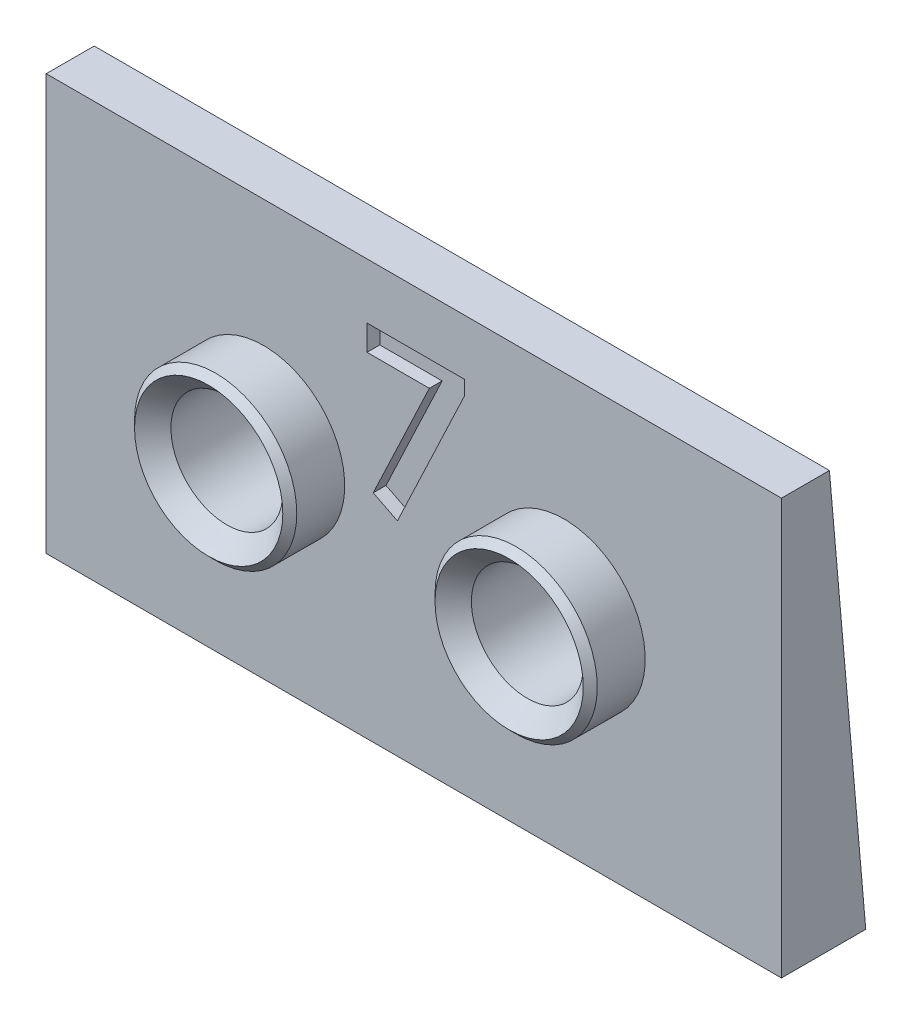
ISO-10303-21;
HEADER;
FILE_DESCRIPTION(('STEP AP214'),'2;1');
FILE_NAME('part.step','',(''),(''),'','','');
FILE_SCHEMA(('AUTOMOTIVE_DESIGN { 1 0 10303 214 1 1 1 1 }'));
ENDSEC;
DATA;
#1=APPLICATION_CONTEXT('core data for automotive mechanical design processes');
#2=APPLICATION_PROTOCOL_DEFINITION('international standard','automotive_design',2000,#1);
#3=PRODUCT_CONTEXT('',#1,'mechanical');
#4=PRODUCT('Part','Part','',(#3));
#5=PRODUCT_RELATED_PRODUCT_CATEGORY('part','',(#4));
#6=PRODUCT_DEFINITION_FORMATION('','',#4);
#7=PRODUCT_DEFINITION_CONTEXT('part definition',#1,'design');
#8=PRODUCT_DEFINITION('design','',#6,#7);
#9=PRODUCT_DEFINITION_SHAPE('','',#8);
#10=(LENGTH_UNIT() NAMED_UNIT(*) SI_UNIT(.MILLI.,.METRE.));
#11=(NAMED_UNIT(*) PLANE_ANGLE_UNIT() SI_UNIT($,.RADIAN.));
#12=(NAMED_UNIT(*) SI_UNIT($,.STERADIAN.) SOLID_ANGLE_UNIT());
#13=UNCERTAINTY_MEASURE_WITH_UNIT(LENGTH_MEASURE(1.E-05),#10,'distance_accuracy_value','');
#14=(GEOMETRIC_REPRESENTATION_CONTEXT(3) GLOBAL_UNCERTAINTY_ASSIGNED_CONTEXT((#13)) GLOBAL_UNIT_ASSIGNED_CONTEXT((#10,
#11,#12)) REPRESENTATION_CONTEXT('',''));
#15=CARTESIAN_POINT('',(0.,0.,0.));
#16=DIRECTION('',(0.,0.,1.));
#17=DIRECTION('',(1.,0.,0.));
#18=AXIS2_PLACEMENT_3D('',#15,#16,#17);
#19=CARTESIAN_POINT('',(0.,0.,3.));
#20=DIRECTION('',(0.,0.,-1.));
#21=DIRECTION('',(-1.,0.,0.));
#22=AXIS2_PLACEMENT_3D('',#19,#20,#21);
#23=PLANE('',#22);
#24=DIRECTION('',(0.,-1.,0.));
#25=VECTOR('',#24,1.);
#26=CARTESIAN_POINT('',(0.,0.,3.));
#27=LINE('',#26,#25);
#28=CARTESIAN_POINT('',(0.,26.,3.));
#29=VERTEX_POINT('',#28);
#30=CARTESIAN_POINT('',(0.,0.,3.));
#31=VERTEX_POINT('',#30);
#32=EDGE_CURVE('E167',#29,#31,#27,.T.);
#33=ORIENTED_EDGE('',*,*,#32,.T.);
#34=DIRECTION('',(1.,0.,0.));
#35=VECTOR('',#34,1.);
#36=CARTESIAN_POINT('',(0.,0.,3.));
#37=LINE('',#36,#35);
#38=CARTESIAN_POINT('',(46.,0.,3.));
#39=VERTEX_POINT('',#38);
#40=EDGE_CURVE('E169',#31,#39,#37,.T.);
#41=ORIENTED_EDGE('',*,*,#40,.T.);
#42=DIRECTION('',(0.,1.,0.));
#43=VECTOR('',#42,1.);
#44=CARTESIAN_POINT('',(46.,0.,3.));
#45=LINE('',#44,#43);
#46=CARTESIAN_POINT('',(46.,26.,3.));
#47=VERTEX_POINT('',#46);
#48=EDGE_CURVE('E171',#39,#47,#45,.T.);
#49=ORIENTED_EDGE('',*,*,#48,.T.);
#50=DIRECTION('',(-1.,0.,0.));
#51=VECTOR('',#50,1.);
#52=CARTESIAN_POINT('',(0.,26.,3.));
#53=LINE('',#52,#51);
#54=EDGE_CURVE('E56',#47,#29,#53,.T.);
#55=ORIENTED_EDGE('',*,*,#54,.T.);
#56=EDGE_LOOP('',(#33,#41,#49,#55));
#57=FACE_BOUND('',#56,.T.);
#58=CARTESIAN_POINT('',(13.6,13.,3.));
#59=DIRECTION('',(0.,0.,-1.));
#60=DIRECTION('',(-1.,0.,0.));
#61=AXIS2_PLACEMENT_3D('',#58,#59,#60);
#62=CIRCLE('',#61,5.075);
#63=CARTESIAN_POINT('',(8.525,13.,3.));
#64=VERTEX_POINT('',#63);
#65=EDGE_CURVE('E186',#64,#64,#62,.F.);
#66=ORIENTED_EDGE('',*,*,#65,.F.);
#67=EDGE_LOOP('',(#66));
#68=FACE_BOUND('',#67,.T.);
#69=CARTESIAN_POINT('',(32.4,13.,3.));
#70=DIRECTION('',(0.,0.,-1.));
#71=DIRECTION('',(-1.,0.,0.));
#72=AXIS2_PLACEMENT_3D('',#69,#70,#71);
#73=CIRCLE('',#72,5.075);
#74=CARTESIAN_POINT('',(27.325,13.,3.));
#75=VERTEX_POINT('',#74);
#76=EDGE_CURVE('E189',#75,#75,#73,.F.);
#77=ORIENTED_EDGE('',*,*,#76,.F.);
#78=EDGE_LOOP('',(#77));
#79=FACE_BOUND('',#78,.T.);
#80=DIRECTION('',(0.,1.,0.));
#81=VECTOR('',#80,1.);
#82=CARTESIAN_POINT('',(20.0692307692308,20.9375,3.));
#83=LINE('',#82,#81);
#84=CARTESIAN_POINT('',(20.0692307692308,20.9375,3.));
#85=VERTEX_POINT('',#84);
#86=CARTESIAN_POINT('',(20.0692307692308,22.525,3.));
#87=VERTEX_POINT('',#86);
#88=EDGE_CURVE('E48',#85,#87,#83,.T.);
#89=ORIENTED_EDGE('',*,*,#88,.T.);
#90=DIRECTION('',(1.,0.,0.));
#91=VECTOR('',#90,1.);
#92=CARTESIAN_POINT('',(20.0692307692308,22.525,3.));
#93=LINE('',#92,#91);
#94=CARTESIAN_POINT('',(26.175,22.525,3.));
#95=VERTEX_POINT('',#94);
#96=EDGE_CURVE('E137',#87,#95,#93,.T.);
#97=ORIENTED_EDGE('',*,*,#96,.T.);
#98=DIRECTION('',(0.,-1.,0.));
#99=VECTOR('',#98,1.);
#100=CARTESIAN_POINT('',(26.175,22.525,3.));
#101=LINE('',#100,#99);
#102=CARTESIAN_POINT('',(26.175,21.6377554086538,3.));
#103=VERTEX_POINT('',#102);
#104=EDGE_CURVE('E405',#95,#103,#101,.T.);
#105=ORIENTED_EDGE('',*,*,#104,.T.);
#106=DIRECTION('',(-0.42761047141976,-0.903963099209348,0.));
#107=VECTOR('',#106,1.);
#108=CARTESIAN_POINT('',(26.175,21.6377554086538,3.));
#109=LINE('',#108,#107);
#110=CARTESIAN_POINT('',(21.9734675480769,12.7557692307692,3.));
#111=VERTEX_POINT('',#110);
#112=EDGE_CURVE('E412',#103,#111,#109,.T.);
#113=ORIENTED_EDGE('',*,*,#112,.T.);
#114=DIRECTION('',(-0.893073384293623,0.44991102483306,0.));
#115=VECTOR('',#114,1.);
#116=CARTESIAN_POINT('',(21.9734675480769,12.7557692307692,3.));
#117=LINE('',#116,#115);
#118=CARTESIAN_POINT('',(20.4584735576923,13.5189903846154,3.));
#119=VERTEX_POINT('',#118);
#120=EDGE_CURVE('E415',#111,#119,#117,.T.);
#121=ORIENTED_EDGE('',*,*,#120,.T.);
#122=DIRECTION('',(0.427766523959501,0.903889263670946,0.));
#123=VECTOR('',#122,1.);
#124=CARTESIAN_POINT('',(20.4584735576923,13.5189903846154,3.));
#125=LINE('',#124,#123);
#126=CARTESIAN_POINT('',(23.9692908653846,20.9375,3.));
#127=VERTEX_POINT('',#126);
#128=EDGE_CURVE('E418',#119,#127,#125,.T.);
#129=ORIENTED_EDGE('',*,*,#128,.T.);
#130=DIRECTION('',(-1.,0.,0.));
#131=VECTOR('',#130,1.);
#132=CARTESIAN_POINT('',(23.9692908653846,20.9375,3.));
#133=LINE('',#132,#131);
#134=EDGE_CURVE('E133',#127,#85,#133,.T.);
#135=ORIENTED_EDGE('',*,*,#134,.T.);
#136=EDGE_LOOP('',(#89,#97,#105,#113,#121,#129,#135));
#137=FACE_BOUND('',#136,.T.);
#138=ADVANCED_FACE('F33',(#57,#68,#79,#137),#23,.F.);
#139=CARTESIAN_POINT('',(0.,0.,3.));
#140=DIRECTION('',(1.,0.,0.));
#141=DIRECTION('',(0.,0.,-1.));
#142=AXIS2_PLACEMENT_3D('',#139,#140,#141);
#143=PLANE('',#142);
#144=DIRECTION('',(0.,0.,-1.));
#145=VECTOR('',#144,1.);
#146=CARTESIAN_POINT('',(0.,26.,3.));
#147=LINE('',#146,#145);
#148=CARTESIAN_POINT('',(0.,26.,0.));
#149=VERTEX_POINT('',#148);
#150=EDGE_CURVE('E174',#29,#149,#147,.T.);
#151=ORIENTED_EDGE('',*,*,#150,.T.);
#152=DIRECTION('',(0.,-0.996194698091746,-0.0871557427476514));
#153=VECTOR('',#152,1.);
#154=CARTESIAN_POINT('',(0.,26.,0.));
#155=LINE('',#154,#153);
#156=CARTESIAN_POINT('',(0.,0.,-2.27470525167385));
#157=VERTEX_POINT('',#156);
#158=EDGE_CURVE('E161',#149,#157,#155,.T.);
#159=ORIENTED_EDGE('',*,*,#158,.T.);
#160=DIRECTION('',(0.,0.,-1.));
#161=VECTOR('',#160,1.);
#162=CARTESIAN_POINT('',(0.,0.,3.));
#163=LINE('',#162,#161);
#164=EDGE_CURVE('E184',#31,#157,#163,.T.);
#165=ORIENTED_EDGE('',*,*,#164,.F.);
#166=ORIENTED_EDGE('',*,*,#32,.F.);
#167=EDGE_LOOP('',(#151,#159,#165,#166));
#168=FACE_BOUND('',#167,.T.);
#169=ADVANCED_FACE('F224',(#168),#143,.F.);
#170=CARTESIAN_POINT('',(0.,0.,3.));
#171=DIRECTION('',(0.,1.,0.));
#172=DIRECTION('',(0.,0.,1.));
#173=AXIS2_PLACEMENT_3D('',#170,#171,#172);
#174=PLANE('',#173);
#175=ORIENTED_EDGE('',*,*,#164,.T.);
#176=DIRECTION('',(-1.,0.,0.));
#177=VECTOR('',#176,1.);
#178=CARTESIAN_POINT('',(72.099315776127,0.,-2.27470525167385));
#179=LINE('',#178,#177);
#180=CARTESIAN_POINT('',(46.,0.,-2.27470525167385));
#181=VERTEX_POINT('',#180);
#182=EDGE_CURVE('E160',#181,#157,#179,.T.);
#183=ORIENTED_EDGE('',*,*,#182,.F.);
#184=DIRECTION('',(0.,0.,-1.));
#185=VECTOR('',#184,1.);
#186=CARTESIAN_POINT('',(46.,0.,3.));
#187=LINE('',#186,#185);
#188=EDGE_CURVE('E182',#39,#181,#187,.T.);
#189=ORIENTED_EDGE('',*,*,#188,.F.);
#190=ORIENTED_EDGE('',*,*,#40,.F.);
#191=EDGE_LOOP('',(#175,#183,#189,#190));
#192=FACE_BOUND('',#191,.T.);
#193=ADVANCED_FACE('F229',(#192),#174,.F.);
#194=CARTESIAN_POINT('',(46.,0.,3.));
#195=DIRECTION('',(-1.,0.,0.));
#196=DIRECTION('',(0.,0.,1.));
#197=AXIS2_PLACEMENT_3D('',#194,#195,#196);
#198=PLANE('',#197);
#199=ORIENTED_EDGE('',*,*,#188,.T.);
#200=DIRECTION('',(0.,0.996194698091746,0.0871557427476514));
#201=VECTOR('',#200,1.);
#202=CARTESIAN_POINT('',(46.,26.,0.));
#203=LINE('',#202,#201);
#204=CARTESIAN_POINT('',(46.,26.,0.));
#205=VERTEX_POINT('',#204);
#206=EDGE_CURVE('E157',#181,#205,#203,.T.);
#207=ORIENTED_EDGE('',*,*,#206,.T.);
#208=DIRECTION('',(0.,0.,-1.));
#209=VECTOR('',#208,1.);
#210=CARTESIAN_POINT('',(46.,26.,3.));
#211=LINE('',#210,#209);
#212=EDGE_CURVE('E179',#47,#205,#211,.T.);
#213=ORIENTED_EDGE('',*,*,#212,.F.);
#214=ORIENTED_EDGE('',*,*,#48,.F.);
#215=EDGE_LOOP('',(#199,#207,#213,#214));
#216=FACE_BOUND('',#215,.T.);
#217=ADVANCED_FACE('F240',(#216),#198,.F.);
#218=CARTESIAN_POINT('',(0.,26.,3.));
#219=DIRECTION('',(0.,-1.,0.));
#220=DIRECTION('',(0.,0.,-1.));
#221=AXIS2_PLACEMENT_3D('',#218,#219,#220);
#222=PLANE('',#221);
#223=DIRECTION('',(-1.,0.,0.));
#224=VECTOR('',#223,1.);
#225=CARTESIAN_POINT('',(0.,26.,0.));
#226=LINE('',#225,#224);
#227=EDGE_CURVE('E159',#205,#149,#226,.T.);
#228=ORIENTED_EDGE('',*,*,#227,.T.);
#229=ORIENTED_EDGE('',*,*,#150,.F.);
#230=ORIENTED_EDGE('',*,*,#54,.F.);
#231=ORIENTED_EDGE('',*,*,#212,.T.);
#232=EDGE_LOOP('',(#228,#229,#230,#231));
#233=FACE_BOUND('',#232,.T.);
#234=ADVANCED_FACE('F237',(#233),#222,.F.);
#235=CARTESIAN_POINT('',(13.6,13.,6.5));
#236=DIRECTION('',(0.,0.,-1.));
#237=DIRECTION('',(-1.,0.,0.));
#238=AXIS2_PLACEMENT_3D('',#235,#236,#237);
#239=CYLINDRICAL_SURFACE('',#238,5.075);
#240=CARTESIAN_POINT('',(13.6,13.,6.));
#241=DIRECTION('',(0.,0.,1.));
#242=DIRECTION('',(1.,0.,0.));
#243=AXIS2_PLACEMENT_3D('',#240,#241,#242);
#244=CIRCLE('',#243,5.075);
#245=CARTESIAN_POINT('',(18.675,13.,6.));
#246=VERTEX_POINT('',#245);
#247=EDGE_CURVE('E11',#246,#246,#244,.F.);
#248=ORIENTED_EDGE('',*,*,#247,.T.);
#249=EDGE_LOOP('',(#248));
#250=FACE_BOUND('',#249,.T.);
#251=ORIENTED_EDGE('',*,*,#65,.T.);
#252=EDGE_LOOP('',(#251));
#253=FACE_BOUND('',#252,.T.);
#254=ADVANCED_FACE('F235',(#250,#253),#239,.T.);
#255=CARTESIAN_POINT('',(13.6,13.,6.5));
#256=DIRECTION('',(0.,0.,-1.));
#257=DIRECTION('',(-1.,0.,0.));
#258=AXIS2_PLACEMENT_3D('',#255,#256,#257);
#259=CYLINDRICAL_SURFACE('',#258,3.5);
#260=CARTESIAN_POINT('',(13.6,13.,5.30000000000001));
#261=DIRECTION('',(0.,0.,1.));
#262=DIRECTION('',(1.,0.,0.));
#263=AXIS2_PLACEMENT_3D('',#260,#261,#262);
#264=CIRCLE('',#263,3.5);
#265=CARTESIAN_POINT('',(17.1,13.,5.30000000000001));
#266=VERTEX_POINT('',#265);
#267=EDGE_CURVE('E199',#266,#266,#264,.T.);
#268=ORIENTED_EDGE('',*,*,#267,.T.);
#269=EDGE_LOOP('',(#268));
#270=FACE_BOUND('',#269,.T.);
#271=CARTESIAN_POINT('',(13.6,13.,-1.13735262583692));
#272=DIRECTION('',(0.,0.0871557427476514,-0.996194698091746));
#273=DIRECTION('',(0.,0.996194698091746,0.0871557427476514));
#274=AXIS2_PLACEMENT_3D('',#271,#272,#273);
#275=ELLIPSE('',#274,3.51336943140171,3.5);
#276=CARTESIAN_POINT('',(13.6,16.5,-0.831142303496212));
#277=VERTEX_POINT('',#276);
#278=EDGE_CURVE('E164',#277,#277,#275,.T.);
#279=ORIENTED_EDGE('',*,*,#278,.T.);
#280=EDGE_LOOP('',(#279));
#281=FACE_BOUND('',#280,.T.);
#282=ADVANCED_FACE('F372',(#270,#281),#259,.F.);
#283=CARTESIAN_POINT('',(32.4,13.,6.5));
#284=DIRECTION('',(0.,0.,-1.));
#285=DIRECTION('',(-1.,0.,0.));
#286=AXIS2_PLACEMENT_3D('',#283,#284,#285);
#287=CYLINDRICAL_SURFACE('',#286,5.075);
#288=CARTESIAN_POINT('',(32.4,13.,6.));
#289=DIRECTION('',(0.,0.,1.));
#290=DIRECTION('',(1.,0.,0.));
#291=AXIS2_PLACEMENT_3D('',#288,#289,#290);
#292=CIRCLE('',#291,5.075);
#293=CARTESIAN_POINT('',(37.475,13.,6.));
#294=VERTEX_POINT('',#293);
#295=EDGE_CURVE('E205',#294,#294,#292,.F.);
#296=ORIENTED_EDGE('',*,*,#295,.T.);
#297=EDGE_LOOP('',(#296));
#298=FACE_BOUND('',#297,.T.);
#299=ORIENTED_EDGE('',*,*,#76,.T.);
#300=EDGE_LOOP('',(#299));
#301=FACE_BOUND('',#300,.T.);
#302=ADVANCED_FACE('F369',(#298,#301),#287,.T.);
#303=CARTESIAN_POINT('',(32.4,13.,6.5));
#304=DIRECTION('',(0.,0.,-1.));
#305=DIRECTION('',(-1.,0.,0.));
#306=AXIS2_PLACEMENT_3D('',#303,#304,#305);
#307=CYLINDRICAL_SURFACE('',#306,3.5);
#308=CARTESIAN_POINT('',(32.4,13.,5.30000000000001));
#309=DIRECTION('',(0.,0.,1.));
#310=DIRECTION('',(1.,0.,0.));
#311=AXIS2_PLACEMENT_3D('',#308,#309,#310);
#312=CIRCLE('',#311,3.5);
#313=CARTESIAN_POINT('',(35.9,13.,5.30000000000001));
#314=VERTEX_POINT('',#313);
#315=EDGE_CURVE('E192',#314,#314,#312,.T.);
#316=ORIENTED_EDGE('',*,*,#315,.T.);
#317=EDGE_LOOP('',(#316));
#318=FACE_BOUND('',#317,.T.);
#319=CARTESIAN_POINT('',(32.4,13.,-1.13735262583692));
#320=DIRECTION('',(0.,0.0871557427476514,-0.996194698091746));
#321=DIRECTION('',(0.,0.996194698091746,0.0871557427476514));
#322=AXIS2_PLACEMENT_3D('',#319,#320,#321);
#323=ELLIPSE('',#322,3.51336943140172,3.50000000000001);
#324=CARTESIAN_POINT('',(32.4,16.5,-0.831142303496212));
#325=VERTEX_POINT('',#324);
#326=EDGE_CURVE('E154',#325,#325,#323,.T.);
#327=ORIENTED_EDGE('',*,*,#326,.T.);
#328=EDGE_LOOP('',(#327));
#329=FACE_BOUND('',#328,.T.);
#330=ADVANCED_FACE('F365',(#318,#329),#307,.F.);
#331=CARTESIAN_POINT('',(72.099315776127,26.,0.));
#332=DIRECTION('',(0.,0.0871557427476514,-0.996194698091746));
#333=DIRECTION('',(0.,0.996194698091746,0.0871557427476514));
#334=AXIS2_PLACEMENT_3D('',#331,#332,#333);
#335=PLANE('',#334);
#336=CARTESIAN_POINT('',(23.,6.67416366711741,-1.69079159228451));
#337=DIRECTION('',(0.,0.0871557427476514,-0.996194698091746));
#338=DIRECTION('',(0.,0.996194698091746,0.0871557427476514));
#339=AXIS2_PLACEMENT_3D('',#336,#337,#338);
#340=CIRCLE('',#339,2.55);
#341=CARTESIAN_POINT('',(23.,9.21446014725137,-1.468544448278));
#342=VERTEX_POINT('',#341);
#343=EDGE_CURVE('E138',#342,#342,#340,.T.);
#344=ORIENTED_EDGE('',*,*,#343,.F.);
#345=EDGE_LOOP('',(#344));
#346=FACE_BOUND('',#345,.T.);
#347=CARTESIAN_POINT('',(23.,19.3258363328826,-0.583913659389336));
#348=DIRECTION('',(0.,0.0871557427476514,-0.996194698091746));
#349=DIRECTION('',(0.,0.996194698091746,0.0871557427476514));
#350=AXIS2_PLACEMENT_3D('',#347,#348,#349);
#351=CIRCLE('',#350,2.55);
#352=CARTESIAN_POINT('',(23.,21.8661328130165,-0.361666515382825));
#353=VERTEX_POINT('',#352);
#354=EDGE_CURVE('E149',#353,#353,#351,.T.);
#355=ORIENTED_EDGE('',*,*,#354,.F.);
#356=EDGE_LOOP('',(#355));
#357=FACE_BOUND('',#356,.T.);
#358=ORIENTED_EDGE('',*,*,#326,.F.);
#359=EDGE_LOOP('',(#358));
#360=FACE_BOUND('',#359,.T.);
#361=ORIENTED_EDGE('',*,*,#278,.F.);
#362=EDGE_LOOP('',(#361));
#363=FACE_BOUND('',#362,.T.);
#364=ORIENTED_EDGE('',*,*,#206,.F.);
#365=ORIENTED_EDGE('',*,*,#182,.T.);
#366=ORIENTED_EDGE('',*,*,#158,.F.);
#367=ORIENTED_EDGE('',*,*,#227,.F.);
#368=EDGE_LOOP('',(#364,#365,#366,#367));
#369=FACE_BOUND('',#368,.T.);
#370=ADVANCED_FACE('F361',(#346,#357,#360,#363,#369),#335,.T.);
#371=CARTESIAN_POINT('',(23.,19.1340936988378,1.60771467641251));
#372=DIRECTION('',(0.,0.0871557427476514,-0.996194698091746));
#373=DIRECTION('',(0.,0.996194698091746,0.0871557427476514));
#374=AXIS2_PLACEMENT_3D('',#371,#372,#373);
#375=CYLINDRICAL_SURFACE('',#374,2.55);
#376=CARTESIAN_POINT('',(23.,19.1340936988378,1.60771467641251));
#377=DIRECTION('',(0.,0.0871557427476514,-0.996194698091746));
#378=DIRECTION('',(0.,0.996194698091746,0.0871557427476514));
#379=AXIS2_PLACEMENT_3D('',#376,#377,#378);
#380=CIRCLE('',#379,2.55);
#381=CARTESIAN_POINT('',(23.,21.6743901789717,1.82996182041902));
#382=VERTEX_POINT('',#381);
#383=EDGE_CURVE('E151',#382,#382,#380,.T.);
#384=ORIENTED_EDGE('',*,*,#383,.F.);
#385=EDGE_LOOP('',(#384));
#386=FACE_BOUND('',#385,.T.);
#387=ORIENTED_EDGE('',*,*,#354,.T.);
#388=EDGE_LOOP('',(#387));
#389=FACE_BOUND('',#388,.T.);
#390=ADVANCED_FACE('F357',(#386,#389),#375,.F.);
#391=CARTESIAN_POINT('',(23.,19.1340936988378,1.60771467641251));
#392=DIRECTION('',(0.,0.0871557427476514,-0.996194698091746));
#393=DIRECTION('',(0.,0.996194698091746,0.0871557427476514));
#394=AXIS2_PLACEMENT_3D('',#391,#392,#393);
#395=PLANE('',#394);
#396=ORIENTED_EDGE('',*,*,#383,.T.);
#397=EDGE_LOOP('',(#396));
#398=FACE_BOUND('',#397,.T.);
#399=ADVANCED_FACE('F353',(#398),#395,.T.);
#400=CARTESIAN_POINT('',(23.,6.48242103307258,0.500836743517333));
#401=DIRECTION('',(0.,0.0871557427476514,-0.996194698091746));
#402=DIRECTION('',(0.,0.996194698091746,0.0871557427476514));
#403=AXIS2_PLACEMENT_3D('',#400,#401,#402);
#404=CYLINDRICAL_SURFACE('',#403,2.55);
#405=CARTESIAN_POINT('',(23.,6.48242103307258,0.500836743517333));
#406=DIRECTION('',(0.,0.0871557427476514,-0.996194698091746));
#407=DIRECTION('',(0.,0.996194698091746,0.0871557427476514));
#408=AXIS2_PLACEMENT_3D('',#405,#406,#407);
#409=CIRCLE('',#408,2.55);
#410=CARTESIAN_POINT('',(23.,9.02271751320653,0.723083887523844));
#411=VERTEX_POINT('',#410);
#412=EDGE_CURVE('E142',#411,#411,#409,.T.);
#413=ORIENTED_EDGE('',*,*,#412,.F.);
#414=EDGE_LOOP('',(#413));
#415=FACE_BOUND('',#414,.T.);
#416=ORIENTED_EDGE('',*,*,#343,.T.);
#417=EDGE_LOOP('',(#416));
#418=FACE_BOUND('',#417,.T.);
#419=ADVANCED_FACE('F349',(#415,#418),#404,.F.);
#420=CARTESIAN_POINT('',(23.,6.48242103307258,0.500836743517333));
#421=DIRECTION('',(0.,0.0871557427476514,-0.996194698091746));
#422=DIRECTION('',(0.,0.996194698091746,0.0871557427476514));
#423=AXIS2_PLACEMENT_3D('',#420,#421,#422);
#424=PLANE('',#423);
#425=ORIENTED_EDGE('',*,*,#412,.T.);
#426=EDGE_LOOP('',(#425));
#427=FACE_BOUND('',#426,.T.);
#428=ADVANCED_FACE('F251',(#427),#424,.T.);
#429=CARTESIAN_POINT('',(32.4,13.,5.30000000000001));
#430=DIRECTION('',(0.,0.,1.));
#431=DIRECTION('',(1.,0.,0.));
#432=AXIS2_PLACEMENT_3D('',#429,#430,#431);
#433=CONICAL_SURFACE('',#432,3.5,0.785398163397453);
#434=CARTESIAN_POINT('',(32.4,13.,6.4375));
#435=DIRECTION('',(0.,0.,-1.));
#436=DIRECTION('',(-1.,0.,0.));
#437=AXIS2_PLACEMENT_3D('',#434,#435,#436);
#438=CIRCLE('',#437,4.63749999999999);
#439=CARTESIAN_POINT('',(27.7625,13.,6.4375));
#440=VERTEX_POINT('',#439);
#441=EDGE_CURVE('E202',#440,#440,#438,.F.);
#442=ORIENTED_EDGE('',*,*,#441,.T.);
#443=EDGE_LOOP('',(#442));
#444=FACE_BOUND('',#443,.T.);
#445=ORIENTED_EDGE('',*,*,#315,.F.);
#446=EDGE_LOOP('',(#445));
#447=FACE_BOUND('',#446,.T.);
#448=ADVANCED_FACE('F248',(#444,#447),#433,.F.);
#449=CARTESIAN_POINT('',(13.6,13.,5.30000000000001));
#450=DIRECTION('',(0.,0.,1.));
#451=DIRECTION('',(1.,0.,0.));
#452=AXIS2_PLACEMENT_3D('',#449,#450,#451);
#453=CONICAL_SURFACE('',#452,3.5,0.785398163397451);
#454=CARTESIAN_POINT('',(13.6,13.,6.4375));
#455=DIRECTION('',(0.,0.,-1.));
#456=DIRECTION('',(-1.,0.,0.));
#457=AXIS2_PLACEMENT_3D('',#454,#455,#456);
#458=CIRCLE('',#457,4.63749999999999);
#459=CARTESIAN_POINT('',(8.9625,13.,6.4375));
#460=VERTEX_POINT('',#459);
#461=EDGE_CURVE('E41',#460,#460,#458,.F.);
#462=ORIENTED_EDGE('',*,*,#461,.T.);
#463=EDGE_LOOP('',(#462));
#464=FACE_BOUND('',#463,.T.);
#465=ORIENTED_EDGE('',*,*,#267,.F.);
#466=EDGE_LOOP('',(#465));
#467=FACE_BOUND('',#466,.T.);
#468=ADVANCED_FACE('F210',(#464,#467),#453,.F.);
#469=CARTESIAN_POINT('',(32.4,13.,6.5));
#470=DIRECTION('',(0.,0.,-1.));
#471=DIRECTION('',(-1.,0.,0.));
#472=AXIS2_PLACEMENT_3D('',#469,#470,#471);
#473=CONICAL_SURFACE('',#472,4.57499999999999,0.785398163397455);
#474=ORIENTED_EDGE('',*,*,#295,.F.);
#475=EDGE_LOOP('',(#474));
#476=FACE_BOUND('',#475,.T.);
#477=ORIENTED_EDGE('',*,*,#441,.F.);
#478=EDGE_LOOP('',(#477));
#479=FACE_BOUND('',#478,.T.);
#480=ADVANCED_FACE('F214',(#476,#479),#473,.T.);
#481=CARTESIAN_POINT('',(13.6,13.,6.5));
#482=DIRECTION('',(0.,0.,-1.));
#483=DIRECTION('',(-1.,0.,0.));
#484=AXIS2_PLACEMENT_3D('',#481,#482,#483);
#485=CONICAL_SURFACE('',#484,4.57499999999999,0.785398163397453);
#486=ORIENTED_EDGE('',*,*,#247,.F.);
#487=EDGE_LOOP('',(#486));
#488=FACE_BOUND('',#487,.T.);
#489=ORIENTED_EDGE('',*,*,#461,.F.);
#490=EDGE_LOOP('',(#489));
#491=FACE_BOUND('',#490,.T.);
#492=ADVANCED_FACE('F35',(#488,#491),#485,.T.);
#493=CARTESIAN_POINT('',(20.0692307692308,20.9375,2.2));
#494=DIRECTION('',(1.,0.,0.));
#495=DIRECTION('',(0.,0.,-1.));
#496=AXIS2_PLACEMENT_3D('',#493,#494,#495);
#497=PLANE('',#496);
#498=ORIENTED_EDGE('',*,*,#88,.F.);
#499=DIRECTION('',(0.,0.,1.));
#500=VECTOR('',#499,1.);
#501=CARTESIAN_POINT('',(20.0692307692308,20.9375,2.2));
#502=LINE('',#501,#500);
#503=CARTESIAN_POINT('',(20.0692307692308,20.9375,2.2));
#504=VERTEX_POINT('',#503);
#505=EDGE_CURVE('E132',#504,#85,#502,.T.);
#506=ORIENTED_EDGE('',*,*,#505,.F.);
#507=DIRECTION('',(0.,1.,0.));
#508=VECTOR('',#507,1.);
#509=CARTESIAN_POINT('',(20.0692307692308,20.9375,2.2));
#510=LINE('',#509,#508);
#511=CARTESIAN_POINT('',(20.0692307692308,22.525,2.2));
#512=VERTEX_POINT('',#511);
#513=EDGE_CURVE('E123',#504,#512,#510,.T.);
#514=ORIENTED_EDGE('',*,*,#513,.T.);
#515=DIRECTION('',(0.,0.,1.));
#516=VECTOR('',#515,1.);
#517=CARTESIAN_POINT('',(20.0692307692308,22.525,2.2));
#518=LINE('',#517,#516);
#519=EDGE_CURVE('E131',#512,#87,#518,.T.);
#520=ORIENTED_EDGE('',*,*,#519,.T.);
#521=EDGE_LOOP('',(#498,#506,#514,#520));
#522=FACE_BOUND('',#521,.T.);
#523=ADVANCED_FACE('F130',(#522),#497,.T.);
#524=CARTESIAN_POINT('',(20.0692307692308,22.525,2.2));
#525=DIRECTION('',(0.,-1.,0.));
#526=DIRECTION('',(0.,0.,-1.));
#527=AXIS2_PLACEMENT_3D('',#524,#525,#526);
#528=PLANE('',#527);
#529=ORIENTED_EDGE('',*,*,#96,.F.);
#530=ORIENTED_EDGE('',*,*,#519,.F.);
#531=DIRECTION('',(1.,0.,0.));
#532=VECTOR('',#531,1.);
#533=CARTESIAN_POINT('',(20.0692307692308,22.525,2.2));
#534=LINE('',#533,#532);
#535=CARTESIAN_POINT('',(26.175,22.525,2.2));
#536=VERTEX_POINT('',#535);
#537=EDGE_CURVE('E119',#512,#536,#534,.T.);
#538=ORIENTED_EDGE('',*,*,#537,.T.);
#539=DIRECTION('',(0.,0.,1.));
#540=VECTOR('',#539,1.);
#541=CARTESIAN_POINT('',(26.175,22.525,2.2));
#542=LINE('',#541,#540);
#543=EDGE_CURVE('E139',#536,#95,#542,.T.);
#544=ORIENTED_EDGE('',*,*,#543,.T.);
#545=EDGE_LOOP('',(#529,#530,#538,#544));
#546=FACE_BOUND('',#545,.T.);
#547=ADVANCED_FACE('F135',(#546),#528,.T.);
#548=CARTESIAN_POINT('',(26.175,22.525,2.2));
#549=DIRECTION('',(-1.,0.,0.));
#550=DIRECTION('',(0.,0.,1.));
#551=AXIS2_PLACEMENT_3D('',#548,#549,#550);
#552=PLANE('',#551);
#553=ORIENTED_EDGE('',*,*,#104,.F.);
#554=ORIENTED_EDGE('',*,*,#543,.F.);
#555=DIRECTION('',(0.,-1.,0.));
#556=VECTOR('',#555,1.);
#557=CARTESIAN_POINT('',(26.175,22.525,2.2));
#558=LINE('',#557,#556);
#559=CARTESIAN_POINT('',(26.175,21.6377554086538,2.2));
#560=VERTEX_POINT('',#559);
#561=EDGE_CURVE('E125',#536,#560,#558,.T.);
#562=ORIENTED_EDGE('',*,*,#561,.T.);
#563=DIRECTION('',(0.,0.,1.));
#564=VECTOR('',#563,1.);
#565=CARTESIAN_POINT('',(26.175,21.6377554086538,2.2));
#566=LINE('',#565,#564);
#567=EDGE_CURVE('E144',#560,#103,#566,.T.);
#568=ORIENTED_EDGE('',*,*,#567,.T.);
#569=EDGE_LOOP('',(#553,#554,#562,#568));
#570=FACE_BOUND('',#569,.T.);
#571=ADVANCED_FACE('F286',(#570),#552,.T.);
#572=CARTESIAN_POINT('',(26.175,21.6377554086538,2.2));
#573=DIRECTION('',(-0.903963099209348,0.42761047141976,0.));
#574=DIRECTION('',(-0.42761047141976,-0.903963099209349,0.));
#575=AXIS2_PLACEMENT_3D('',#572,#573,#574);
#576=PLANE('',#575);
#577=ORIENTED_EDGE('',*,*,#112,.F.);
#578=ORIENTED_EDGE('',*,*,#567,.F.);
#579=DIRECTION('',(-0.42761047141976,-0.903963099209348,0.));
#580=VECTOR('',#579,1.);
#581=CARTESIAN_POINT('',(26.175,21.6377554086538,2.2));
#582=LINE('',#581,#580);
#583=CARTESIAN_POINT('',(21.9734675480769,12.7557692307692,2.2));
#584=VERTEX_POINT('',#583);
#585=EDGE_CURVE('E439',#560,#584,#582,.T.);
#586=ORIENTED_EDGE('',*,*,#585,.T.);
#587=DIRECTION('',(0.,0.,1.));
#588=VECTOR('',#587,1.);
#589=CARTESIAN_POINT('',(21.9734675480769,12.7557692307692,2.2));
#590=LINE('',#589,#588);
#591=EDGE_CURVE('E426',#584,#111,#590,.T.);
#592=ORIENTED_EDGE('',*,*,#591,.T.);
#593=EDGE_LOOP('',(#577,#578,#586,#592));
#594=FACE_BOUND('',#593,.T.);
#595=ADVANCED_FACE('F295',(#594),#576,.T.);
#596=CARTESIAN_POINT('',(21.9734675480769,12.7557692307692,2.2));
#597=DIRECTION('',(0.44991102483306,0.893073384293623,0.));
#598=DIRECTION('',(-0.893073384293623,0.44991102483306,0.));
#599=AXIS2_PLACEMENT_3D('',#596,#597,#598);
#600=PLANE('',#599);
#601=ORIENTED_EDGE('',*,*,#120,.F.);
#602=ORIENTED_EDGE('',*,*,#591,.F.);
#603=DIRECTION('',(-0.893073384293623,0.44991102483306,0.));
#604=VECTOR('',#603,1.);
#605=CARTESIAN_POINT('',(21.9734675480769,12.7557692307692,2.2));
#606=LINE('',#605,#604);
#607=CARTESIAN_POINT('',(20.4584735576923,13.5189903846154,2.2));
#608=VERTEX_POINT('',#607);
#609=EDGE_CURVE('E435',#584,#608,#606,.T.);
#610=ORIENTED_EDGE('',*,*,#609,.T.);
#611=DIRECTION('',(0.,0.,1.));
#612=VECTOR('',#611,1.);
#613=CARTESIAN_POINT('',(20.4584735576923,13.5189903846154,2.2));
#614=LINE('',#613,#612);
#615=EDGE_CURVE('E424',#608,#119,#614,.T.);
#616=ORIENTED_EDGE('',*,*,#615,.T.);
#617=EDGE_LOOP('',(#601,#602,#610,#616));
#618=FACE_BOUND('',#617,.T.);
#619=ADVANCED_FACE('F305',(#618),#600,.T.);
#620=CARTESIAN_POINT('',(20.4584735576923,13.5189903846154,2.2));
#621=DIRECTION('',(0.903889263670946,-0.427766523959501,0.));
#622=DIRECTION('',(0.427766523959501,0.903889263670946,0.));
#623=AXIS2_PLACEMENT_3D('',#620,#621,#622);
#624=PLANE('',#623);
#625=ORIENTED_EDGE('',*,*,#128,.F.);
#626=ORIENTED_EDGE('',*,*,#615,.F.);
#627=DIRECTION('',(0.427766523959501,0.903889263670946,0.));
#628=VECTOR('',#627,1.);
#629=CARTESIAN_POINT('',(20.4584735576923,13.5189903846154,2.2));
#630=LINE('',#629,#628);
#631=CARTESIAN_POINT('',(23.9692908653846,20.9375,2.2));
#632=VERTEX_POINT('',#631);
#633=EDGE_CURVE('E438',#608,#632,#630,.T.);
#634=ORIENTED_EDGE('',*,*,#633,.T.);
#635=DIRECTION('',(0.,0.,1.));
#636=VECTOR('',#635,1.);
#637=CARTESIAN_POINT('',(23.9692908653846,20.9375,2.2));
#638=LINE('',#637,#636);
#639=EDGE_CURVE('E422',#632,#127,#638,.T.);
#640=ORIENTED_EDGE('',*,*,#639,.T.);
#641=EDGE_LOOP('',(#625,#626,#634,#640));
#642=FACE_BOUND('',#641,.T.);
#643=ADVANCED_FACE('F315',(#642),#624,.T.);
#644=CARTESIAN_POINT('',(23.9692908653846,20.9375,2.2));
#645=DIRECTION('',(0.,1.,0.));
#646=DIRECTION('',(0.,0.,1.));
#647=AXIS2_PLACEMENT_3D('',#644,#645,#646);
#648=PLANE('',#647);
#649=ORIENTED_EDGE('',*,*,#134,.F.);
#650=ORIENTED_EDGE('',*,*,#639,.F.);
#651=DIRECTION('',(-1.,0.,0.));
#652=VECTOR('',#651,1.);
#653=CARTESIAN_POINT('',(23.9692908653846,20.9375,2.2));
#654=LINE('',#653,#652);
#655=EDGE_CURVE('E408',#632,#504,#654,.T.);
#656=ORIENTED_EDGE('',*,*,#655,.T.);
#657=ORIENTED_EDGE('',*,*,#505,.T.);
#658=EDGE_LOOP('',(#649,#650,#656,#657));
#659=FACE_BOUND('',#658,.T.);
#660=ADVANCED_FACE('F325',(#659),#648,.T.);
#661=CARTESIAN_POINT('',(0.,0.,2.2));
#662=DIRECTION('',(0.,0.,-1.));
#663=DIRECTION('',(-1.,0.,0.));
#664=AXIS2_PLACEMENT_3D('',#661,#662,#663);
#665=PLANE('',#664);
#666=ORIENTED_EDGE('',*,*,#513,.F.);
#667=ORIENTED_EDGE('',*,*,#655,.F.);
#668=ORIENTED_EDGE('',*,*,#633,.F.);
#669=ORIENTED_EDGE('',*,*,#609,.F.);
#670=ORIENTED_EDGE('',*,*,#585,.F.);
#671=ORIENTED_EDGE('',*,*,#561,.F.);
#672=ORIENTED_EDGE('',*,*,#537,.F.);
#673=EDGE_LOOP('',(#666,#667,#668,#669,#670,#671,#672));
#674=FACE_BOUND('',#673,.T.);
#675=ADVANCED_FACE('F121',(#674),#665,.F.);
#676=CLOSED_SHELL('',(#138,#169,#193,#217,#234,#254,#282,#302,#330,#370,#390,#399,#419,#428,
#448,#468,#480,#492,#523,#547,#571,#595,#619,#643,#660,#675));
#677=MANIFOLD_SOLID_BREP('B2',#676);
#678=ADVANCED_BREP_SHAPE_REPRESENTATION('',(#18,#677),#14);
#679=SHAPE_DEFINITION_REPRESENTATION(#9,#678);
ENDSEC;
END-ISO-10303-21;
